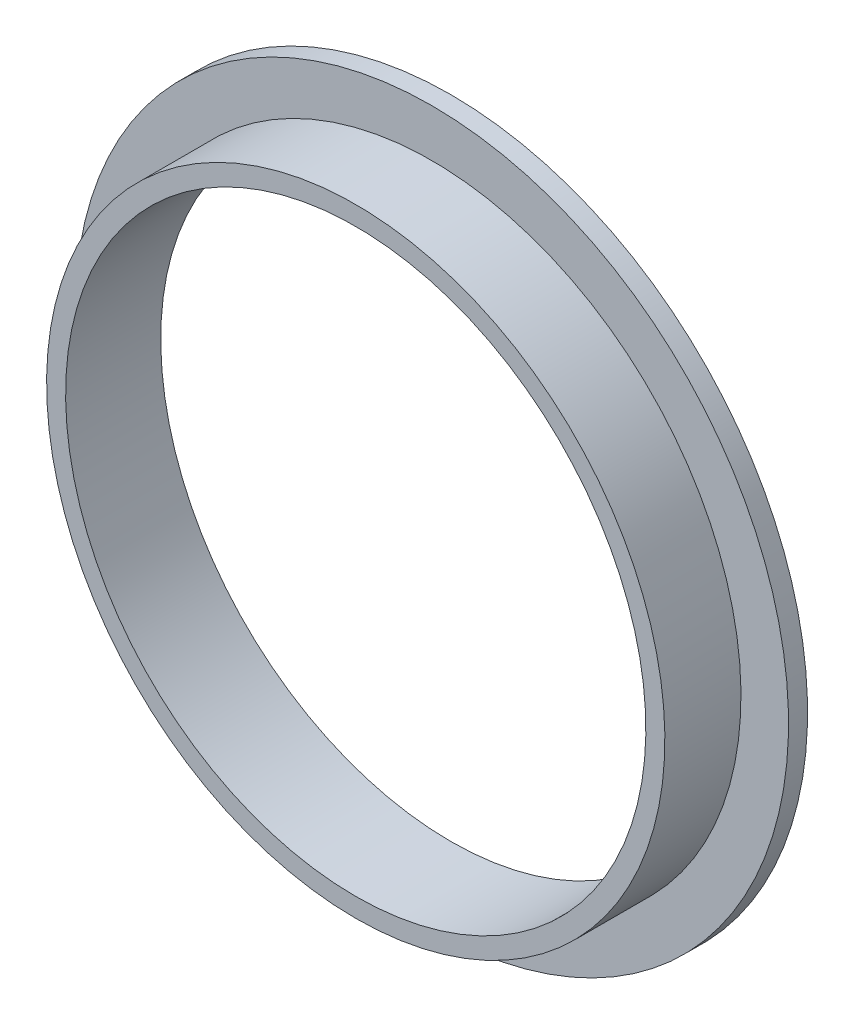
ISO-10303-21;
HEADER;
FILE_DESCRIPTION(('STEP AP214'),'2;1');
FILE_NAME('part.step','',(''),(''),'','','');
FILE_SCHEMA(('AUTOMOTIVE_DESIGN { 1 0 10303 214 1 1 1 1 }'));
ENDSEC;
DATA;
#1=APPLICATION_CONTEXT('core data for automotive mechanical design processes');
#2=APPLICATION_PROTOCOL_DEFINITION('international standard','automotive_design',2000,#1);
#3=PRODUCT_CONTEXT('',#1,'mechanical');
#4=PRODUCT('Part','Part','',(#3));
#5=PRODUCT_RELATED_PRODUCT_CATEGORY('part','',(#4));
#6=PRODUCT_DEFINITION_FORMATION('','',#4);
#7=PRODUCT_DEFINITION_CONTEXT('part definition',#1,'design');
#8=PRODUCT_DEFINITION('design','',#6,#7);
#9=PRODUCT_DEFINITION_SHAPE('','',#8);
#10=(LENGTH_UNIT() NAMED_UNIT(*) SI_UNIT(.MILLI.,.METRE.));
#11=(NAMED_UNIT(*) PLANE_ANGLE_UNIT() SI_UNIT($,.RADIAN.));
#12=(NAMED_UNIT(*) SI_UNIT($,.STERADIAN.) SOLID_ANGLE_UNIT());
#13=UNCERTAINTY_MEASURE_WITH_UNIT(LENGTH_MEASURE(1.E-05),#10,'distance_accuracy_value','');
#14=(GEOMETRIC_REPRESENTATION_CONTEXT(3) GLOBAL_UNCERTAINTY_ASSIGNED_CONTEXT((#13)) GLOBAL_UNIT_ASSIGNED_CONTEXT((#10,
#11,#12)) REPRESENTATION_CONTEXT('',''));
#15=CARTESIAN_POINT('',(0.,0.,0.));
#16=DIRECTION('',(0.,0.,1.));
#17=DIRECTION('',(1.,0.,0.));
#18=AXIS2_PLACEMENT_3D('',#15,#16,#17);
#19=CARTESIAN_POINT('',(0.,51.59375,7.9375));
#20=DIRECTION('',(0.,0.,-1.));
#21=DIRECTION('',(0.,1.,0.));
#22=AXIS2_PLACEMENT_3D('',#19,#20,#21);
#23=PLANE('',#22);
#24=CARTESIAN_POINT('',(0.,0.,7.93749999999999));
#25=DIRECTION('',(0.,0.,1.));
#26=DIRECTION('',(0.,-1.,0.));
#27=AXIS2_PLACEMENT_3D('',#24,#25,#26);
#28=CIRCLE('',#27,48.41875);
#29=CARTESIAN_POINT('',(0.,-48.41875,7.93749999999998));
#30=VERTEX_POINT('',#29);
#31=EDGE_CURVE('E10',#30,#30,#28,.T.);
#32=ORIENTED_EDGE('',*,*,#31,.F.);
#33=EDGE_LOOP('',(#32));
#34=FACE_BOUND('',#33,.T.);
#35=CARTESIAN_POINT('',(0.,0.,7.93749999999999));
#36=DIRECTION('',(0.,0.,1.));
#37=DIRECTION('',(0.,-1.,0.));
#38=AXIS2_PLACEMENT_3D('',#35,#36,#37);
#39=CIRCLE('',#38,51.59375);
#40=CARTESIAN_POINT('',(0.,-51.59375,7.93749999999999));
#41=VERTEX_POINT('',#40);
#42=EDGE_CURVE('E52',#41,#41,#39,.T.);
#43=ORIENTED_EDGE('',*,*,#42,.T.);
#44=EDGE_LOOP('',(#43));
#45=FACE_BOUND('',#44,.T.);
#46=ADVANCED_FACE('F30',(#34,#45),#23,.F.);
#47=CARTESIAN_POINT('',(0.,0.,7.9375));
#48=DIRECTION('',(0.,0.,1.));
#49=DIRECTION('',(0.,-1.,0.));
#50=AXIS2_PLACEMENT_3D('',#47,#48,#49);
#51=CYLINDRICAL_SURFACE('',#50,48.41875);
#52=CARTESIAN_POINT('',(0.,0.,-7.93749999999999));
#53=DIRECTION('',(0.,0.,1.));
#54=DIRECTION('',(0.,-1.,0.));
#55=AXIS2_PLACEMENT_3D('',#52,#53,#54);
#56=CIRCLE('',#55,48.41875);
#57=CARTESIAN_POINT('',(0.,-48.41875,-7.9375));
#58=VERTEX_POINT('',#57);
#59=EDGE_CURVE('E36',#58,#58,#56,.T.);
#60=ORIENTED_EDGE('',*,*,#59,.F.);
#61=EDGE_LOOP('',(#60));
#62=FACE_BOUND('',#61,.T.);
#63=ORIENTED_EDGE('',*,*,#31,.T.);
#64=EDGE_LOOP('',(#63));
#65=FACE_BOUND('',#64,.T.);
#66=ADVANCED_FACE('F77',(#62,#65),#51,.F.);
#67=CARTESIAN_POINT('',(0.,48.41875,-7.93749999999999));
#68=DIRECTION('',(0.,0.,1.));
#69=DIRECTION('',(0.,-1.,0.));
#70=AXIS2_PLACEMENT_3D('',#67,#68,#69);
#71=PLANE('',#70);
#72=CARTESIAN_POINT('',(0.,0.,-7.93750000000001));
#73=DIRECTION('',(0.,0.,1.));
#74=DIRECTION('',(0.,-1.,0.));
#75=AXIS2_PLACEMENT_3D('',#72,#73,#74);
#76=CIRCLE('',#75,59.53125);
#77=CARTESIAN_POINT('',(0.,-59.53125,-7.93750000000002));
#78=VERTEX_POINT('',#77);
#79=EDGE_CURVE('E40',#78,#78,#76,.T.);
#80=ORIENTED_EDGE('',*,*,#79,.F.);
#81=EDGE_LOOP('',(#80));
#82=FACE_BOUND('',#81,.T.);
#83=ORIENTED_EDGE('',*,*,#59,.T.);
#84=EDGE_LOOP('',(#83));
#85=FACE_BOUND('',#84,.T.);
#86=ADVANCED_FACE('F72',(#82,#85),#71,.F.);
#87=CARTESIAN_POINT('',(0.,0.,7.9375));
#88=DIRECTION('',(0.,0.,1.));
#89=DIRECTION('',(0.,-1.,0.));
#90=AXIS2_PLACEMENT_3D('',#87,#88,#89);
#91=CYLINDRICAL_SURFACE('',#90,59.53125);
#92=CARTESIAN_POINT('',(0.,0.,-4.76250000000001));
#93=DIRECTION('',(0.,0.,1.));
#94=DIRECTION('',(0.,-1.,0.));
#95=AXIS2_PLACEMENT_3D('',#92,#93,#94);
#96=CIRCLE('',#95,59.53125);
#97=CARTESIAN_POINT('',(0.,-59.53125,-4.76250000000002));
#98=VERTEX_POINT('',#97);
#99=EDGE_CURVE('E44',#98,#98,#96,.T.);
#100=ORIENTED_EDGE('',*,*,#99,.F.);
#101=EDGE_LOOP('',(#100));
#102=FACE_BOUND('',#101,.T.);
#103=ORIENTED_EDGE('',*,*,#79,.T.);
#104=EDGE_LOOP('',(#103));
#105=FACE_BOUND('',#104,.T.);
#106=ADVANCED_FACE('F66',(#102,#105),#91,.T.);
#107=CARTESIAN_POINT('',(0.,59.53125,-4.7625));
#108=DIRECTION('',(0.,0.,-1.));
#109=DIRECTION('',(0.,1.,0.));
#110=AXIS2_PLACEMENT_3D('',#107,#108,#109);
#111=PLANE('',#110);
#112=CARTESIAN_POINT('',(0.,0.,-4.76250000000001));
#113=DIRECTION('',(0.,0.,1.));
#114=DIRECTION('',(0.,-1.,0.));
#115=AXIS2_PLACEMENT_3D('',#112,#113,#114);
#116=CIRCLE('',#115,51.59375);
#117=CARTESIAN_POINT('',(0.,-51.59375,-4.76250000000002));
#118=VERTEX_POINT('',#117);
#119=EDGE_CURVE('E49',#118,#118,#116,.T.);
#120=ORIENTED_EDGE('',*,*,#119,.F.);
#121=EDGE_LOOP('',(#120));
#122=FACE_BOUND('',#121,.T.);
#123=ORIENTED_EDGE('',*,*,#99,.T.);
#124=EDGE_LOOP('',(#123));
#125=FACE_BOUND('',#124,.T.);
#126=ADVANCED_FACE('F60',(#122,#125),#111,.F.);
#127=CARTESIAN_POINT('',(0.,0.,7.9375));
#128=DIRECTION('',(0.,0.,1.));
#129=DIRECTION('',(0.,-1.,0.));
#130=AXIS2_PLACEMENT_3D('',#127,#128,#129);
#131=CYLINDRICAL_SURFACE('',#130,51.59375);
#132=ORIENTED_EDGE('',*,*,#42,.F.);
#133=EDGE_LOOP('',(#132));
#134=FACE_BOUND('',#133,.T.);
#135=ORIENTED_EDGE('',*,*,#119,.T.);
#136=EDGE_LOOP('',(#135));
#137=FACE_BOUND('',#136,.T.);
#138=ADVANCED_FACE('F57',(#134,#137),#131,.T.);
#139=CLOSED_SHELL('',(#46,#66,#86,#106,#126,#138));
#140=MANIFOLD_SOLID_BREP('B2',#139);
#141=ADVANCED_BREP_SHAPE_REPRESENTATION('',(#18,#140),#14);
#142=SHAPE_DEFINITION_REPRESENTATION(#9,#141);
ENDSEC;
END-ISO-10303-21;
